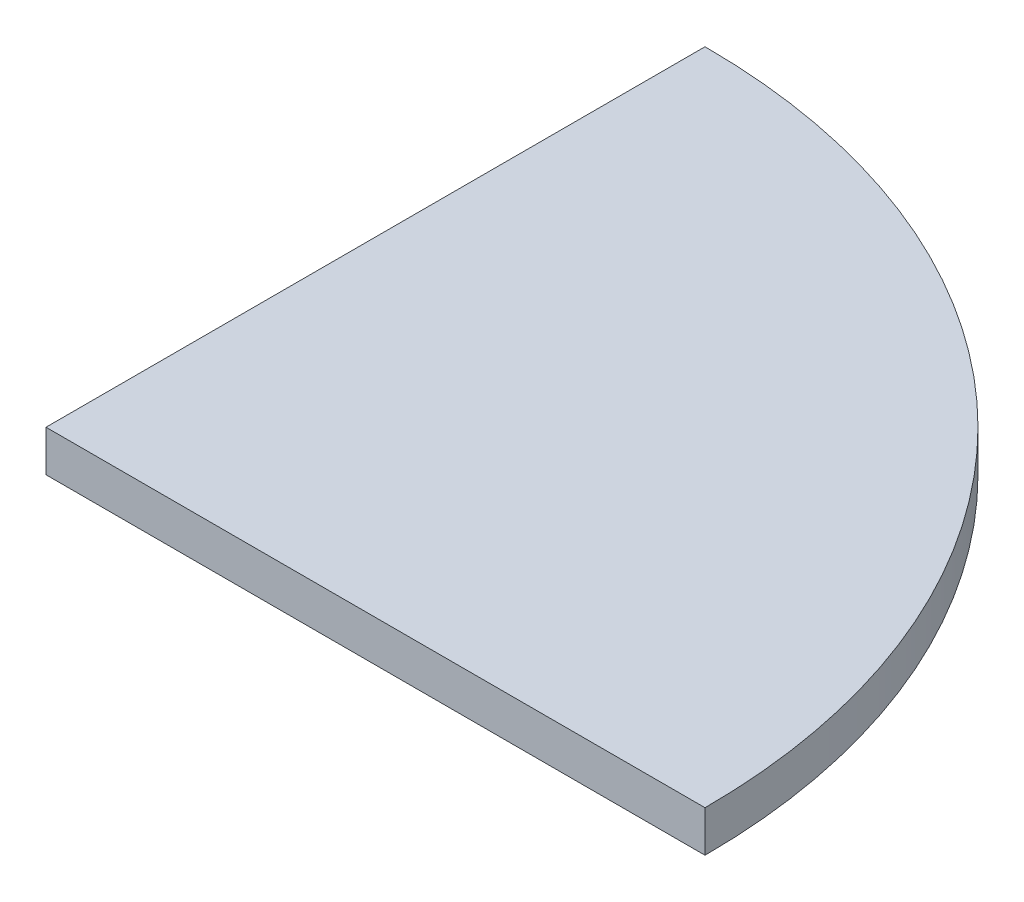
ISO-10303-21;
HEADER;
FILE_DESCRIPTION(('STEP AP214'),'2;1');
FILE_NAME('part.step','',(''),(''),'','','');
FILE_SCHEMA(('AUTOMOTIVE_DESIGN { 1 0 10303 214 1 1 1 1 }'));
ENDSEC;
DATA;
#1=APPLICATION_CONTEXT('core data for automotive mechanical design processes');
#2=APPLICATION_PROTOCOL_DEFINITION('international standard','automotive_design',2000,#1);
#3=PRODUCT_CONTEXT('',#1,'mechanical');
#4=PRODUCT('Part','Part','',(#3));
#5=PRODUCT_RELATED_PRODUCT_CATEGORY('part','',(#4));
#6=PRODUCT_DEFINITION_FORMATION('','',#4);
#7=PRODUCT_DEFINITION_CONTEXT('part definition',#1,'design');
#8=PRODUCT_DEFINITION('design','',#6,#7);
#9=PRODUCT_DEFINITION_SHAPE('','',#8);
#10=(LENGTH_UNIT() NAMED_UNIT(*) SI_UNIT(.MILLI.,.METRE.));
#11=(NAMED_UNIT(*) PLANE_ANGLE_UNIT() SI_UNIT($,.RADIAN.));
#12=(NAMED_UNIT(*) SI_UNIT($,.STERADIAN.) SOLID_ANGLE_UNIT());
#13=UNCERTAINTY_MEASURE_WITH_UNIT(LENGTH_MEASURE(1.E-05),#10,'distance_accuracy_value','');
#14=(GEOMETRIC_REPRESENTATION_CONTEXT(3) GLOBAL_UNCERTAINTY_ASSIGNED_CONTEXT((#13)) GLOBAL_UNIT_ASSIGNED_CONTEXT((#10,
#11,#12)) REPRESENTATION_CONTEXT('',''));
#15=CARTESIAN_POINT('',(0.,0.,0.));
#16=DIRECTION('',(0.,0.,1.));
#17=DIRECTION('',(1.,0.,0.));
#18=AXIS2_PLACEMENT_3D('',#15,#16,#17);
#19=CARTESIAN_POINT('',(0.,19.05,0.));
#20=DIRECTION('',(0.,0.,-1.));
#21=DIRECTION('',(-1.,0.,0.));
#22=AXIS2_PLACEMENT_3D('',#19,#20,#21);
#23=PLANE('',#22);
#24=DIRECTION('',(1.,0.,0.));
#25=VECTOR('',#24,1.);
#26=CARTESIAN_POINT('',(0.,0.,0.));
#27=LINE('',#26,#25);
#28=CARTESIAN_POINT('',(0.,0.,0.));
#29=VERTEX_POINT('',#28);
#30=CARTESIAN_POINT('',(304.8,0.,0.));
#31=VERTEX_POINT('',#30);
#32=EDGE_CURVE('E95',#29,#31,#27,.T.);
#33=ORIENTED_EDGE('',*,*,#32,.T.);
#34=DIRECTION('',(0.,-1.,0.));
#35=VECTOR('',#34,1.);
#36=CARTESIAN_POINT('',(304.8,19.05,0.));
#37=LINE('',#36,#35);
#38=CARTESIAN_POINT('',(304.8,19.05,0.));
#39=VERTEX_POINT('',#38);
#40=EDGE_CURVE('E11',#39,#31,#37,.T.);
#41=ORIENTED_EDGE('',*,*,#40,.F.);
#42=DIRECTION('',(1.,0.,0.));
#43=VECTOR('',#42,1.);
#44=CARTESIAN_POINT('',(0.,19.05,0.));
#45=LINE('',#44,#43);
#46=CARTESIAN_POINT('',(0.,19.05,0.));
#47=VERTEX_POINT('',#46);
#48=EDGE_CURVE('E87',#47,#39,#45,.T.);
#49=ORIENTED_EDGE('',*,*,#48,.F.);
#50=DIRECTION('',(0.,-1.,0.));
#51=VECTOR('',#50,1.);
#52=CARTESIAN_POINT('',(0.,19.05,0.));
#53=LINE('',#52,#51);
#54=EDGE_CURVE('E96',#47,#29,#53,.T.);
#55=ORIENTED_EDGE('',*,*,#54,.T.);
#56=EDGE_LOOP('',(#33,#41,#49,#55));
#57=FACE_BOUND('',#56,.T.);
#58=ADVANCED_FACE('F45',(#57),#23,.F.);
#59=CARTESIAN_POINT('',(0.,19.05,0.));
#60=DIRECTION('',(0.,-1.,0.));
#61=DIRECTION('',(0.,0.,-1.));
#62=AXIS2_PLACEMENT_3D('',#59,#60,#61);
#63=CYLINDRICAL_SURFACE('',#62,304.8);
#64=CARTESIAN_POINT('',(0.,0.,0.));
#65=DIRECTION('',(0.,1.,0.));
#66=DIRECTION('',(0.,0.,1.));
#67=AXIS2_PLACEMENT_3D('',#64,#65,#66);
#68=CIRCLE('',#67,304.8);
#69=CARTESIAN_POINT('',(0.,0.,-304.8));
#70=VERTEX_POINT('',#69);
#71=EDGE_CURVE('E74',#31,#70,#68,.T.);
#72=ORIENTED_EDGE('',*,*,#71,.T.);
#73=DIRECTION('',(0.,-1.,0.));
#74=VECTOR('',#73,1.);
#75=CARTESIAN_POINT('',(0.,19.05,-304.8));
#76=LINE('',#75,#74);
#77=CARTESIAN_POINT('',(0.,19.05,-304.8));
#78=VERTEX_POINT('',#77);
#79=EDGE_CURVE('E54',#78,#70,#76,.T.);
#80=ORIENTED_EDGE('',*,*,#79,.F.);
#81=CARTESIAN_POINT('',(0.,19.05,0.));
#82=DIRECTION('',(0.,1.,0.));
#83=DIRECTION('',(0.,0.,1.));
#84=AXIS2_PLACEMENT_3D('',#81,#82,#83);
#85=CIRCLE('',#84,304.8);
#86=EDGE_CURVE('E82',#39,#78,#85,.T.);
#87=ORIENTED_EDGE('',*,*,#86,.F.);
#88=ORIENTED_EDGE('',*,*,#40,.T.);
#89=EDGE_LOOP('',(#72,#80,#87,#88));
#90=FACE_BOUND('',#89,.T.);
#91=ADVANCED_FACE('F83',(#90),#63,.T.);
#92=CARTESIAN_POINT('',(0.,19.05,-304.8));
#93=DIRECTION('',(1.,0.,0.));
#94=DIRECTION('',(0.,0.,-1.));
#95=AXIS2_PLACEMENT_3D('',#92,#93,#94);
#96=PLANE('',#95);
#97=DIRECTION('',(0.,0.,1.));
#98=VECTOR('',#97,1.);
#99=CARTESIAN_POINT('',(0.,0.,-304.8));
#100=LINE('',#99,#98);
#101=EDGE_CURVE('E79',#70,#29,#100,.T.);
#102=ORIENTED_EDGE('',*,*,#101,.T.);
#103=ORIENTED_EDGE('',*,*,#54,.F.);
#104=DIRECTION('',(0.,0.,1.));
#105=VECTOR('',#104,1.);
#106=CARTESIAN_POINT('',(0.,19.05,-304.8));
#107=LINE('',#106,#105);
#108=EDGE_CURVE('E62',#78,#47,#107,.T.);
#109=ORIENTED_EDGE('',*,*,#108,.F.);
#110=ORIENTED_EDGE('',*,*,#79,.T.);
#111=EDGE_LOOP('',(#102,#103,#109,#110));
#112=FACE_BOUND('',#111,.T.);
#113=ADVANCED_FACE('F108',(#112),#96,.F.);
#114=CARTESIAN_POINT('',(0.,19.05,0.));
#115=DIRECTION('',(0.,1.,0.));
#116=DIRECTION('',(0.,0.,1.));
#117=AXIS2_PLACEMENT_3D('',#114,#115,#116);
#118=PLANE('',#117);
#119=ORIENTED_EDGE('',*,*,#48,.T.);
#120=ORIENTED_EDGE('',*,*,#86,.T.);
#121=ORIENTED_EDGE('',*,*,#108,.T.);
#122=EDGE_LOOP('',(#119,#120,#121));
#123=FACE_BOUND('',#122,.T.);
#124=ADVANCED_FACE('F90',(#123),#118,.T.);
#125=CARTESIAN_POINT('',(0.,0.,0.));
#126=DIRECTION('',(0.,1.,0.));
#127=DIRECTION('',(0.,0.,1.));
#128=AXIS2_PLACEMENT_3D('',#125,#126,#127);
#129=PLANE('',#128);
#130=ORIENTED_EDGE('',*,*,#32,.F.);
#131=ORIENTED_EDGE('',*,*,#101,.F.);
#132=ORIENTED_EDGE('',*,*,#71,.F.);
#133=EDGE_LOOP('',(#130,#131,#132));
#134=FACE_BOUND('',#133,.T.);
#135=ADVANCED_FACE('F109',(#134),#129,.F.);
#136=CLOSED_SHELL('',(#58,#91,#113,#124,#135));
#137=MANIFOLD_SOLID_BREP('B2',#136);
#138=ADVANCED_BREP_SHAPE_REPRESENTATION('',(#18,#137),#14);
#139=SHAPE_DEFINITION_REPRESENTATION(#9,#138);
ENDSEC;
END-ISO-10303-21;
